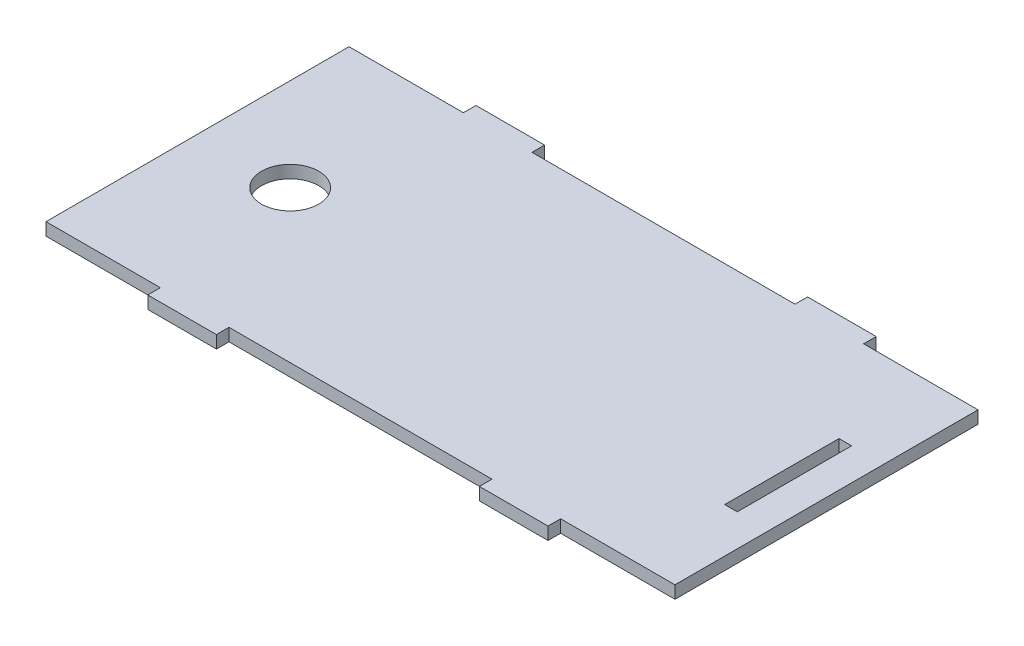
ISO-10303-21;
HEADER;
FILE_DESCRIPTION(('STEP AP214'),'2;1');
FILE_NAME('part.step','',(''),(''),'','','');
FILE_SCHEMA(('AUTOMOTIVE_DESIGN { 1 0 10303 214 1 1 1 1 }'));
ENDSEC;
DATA;
#1=APPLICATION_CONTEXT('core data for automotive mechanical design processes');
#2=APPLICATION_PROTOCOL_DEFINITION('international standard','automotive_design',2000,#1);
#3=PRODUCT_CONTEXT('',#1,'mechanical');
#4=PRODUCT('Part','Part','',(#3));
#5=PRODUCT_RELATED_PRODUCT_CATEGORY('part','',(#4));
#6=PRODUCT_DEFINITION_FORMATION('','',#4);
#7=PRODUCT_DEFINITION_CONTEXT('part definition',#1,'design');
#8=PRODUCT_DEFINITION('design','',#6,#7);
#9=PRODUCT_DEFINITION_SHAPE('','',#8);
#10=(LENGTH_UNIT() NAMED_UNIT(*) SI_UNIT(.MILLI.,.METRE.));
#11=(NAMED_UNIT(*) PLANE_ANGLE_UNIT() SI_UNIT($,.RADIAN.));
#12=(NAMED_UNIT(*) SI_UNIT($,.STERADIAN.) SOLID_ANGLE_UNIT());
#13=UNCERTAINTY_MEASURE_WITH_UNIT(LENGTH_MEASURE(1.E-05),#10,'distance_accuracy_value','');
#14=(GEOMETRIC_REPRESENTATION_CONTEXT(3) GLOBAL_UNCERTAINTY_ASSIGNED_CONTEXT((#13)) GLOBAL_UNIT_ASSIGNED_CONTEXT((#10,
#11,#12)) REPRESENTATION_CONTEXT('',''));
#15=CARTESIAN_POINT('',(0.,0.,0.));
#16=DIRECTION('',(0.,0.,1.));
#17=DIRECTION('',(1.,0.,0.));
#18=AXIS2_PLACEMENT_3D('',#15,#16,#17);
#19=CARTESIAN_POINT('',(0.,2.794,0.));
#20=DIRECTION('',(0.,-1.,0.));
#21=DIRECTION('',(0.,0.,-1.));
#22=AXIS2_PLACEMENT_3D('',#19,#20,#21);
#23=PLANE('',#22);
#24=DIRECTION('',(0.,0.,1.));
#25=VECTOR('',#24,1.);
#26=CARTESIAN_POINT('',(129.794,2.794,-20.955));
#27=LINE('',#26,#25);
#28=CARTESIAN_POINT('',(129.794,2.794,-46.355));
#29=VERTEX_POINT('',#28);
#30=CARTESIAN_POINT('',(129.794,2.794,-20.955));
#31=VERTEX_POINT('',#30);
#32=EDGE_CURVE('E194',#29,#31,#27,.T.);
#33=ORIENTED_EDGE('',*,*,#32,.F.);
#34=DIRECTION('',(-1.,0.,0.));
#35=VECTOR('',#34,1.);
#36=CARTESIAN_POINT('',(132.588,2.794,-46.355));
#37=LINE('',#36,#35);
#38=CARTESIAN_POINT('',(132.588,2.794,-46.355));
#39=VERTEX_POINT('',#38);
#40=EDGE_CURVE('E217',#39,#29,#37,.T.);
#41=ORIENTED_EDGE('',*,*,#40,.F.);
#42=DIRECTION('',(0.,0.,-1.));
#43=VECTOR('',#42,1.);
#44=CARTESIAN_POINT('',(132.588,2.794,-20.955));
#45=LINE('',#44,#43);
#46=CARTESIAN_POINT('',(132.588,2.794,-20.955));
#47=VERTEX_POINT('',#46);
#48=EDGE_CURVE('E215',#47,#39,#45,.T.);
#49=ORIENTED_EDGE('',*,*,#48,.F.);
#50=DIRECTION('',(1.,0.,0.));
#51=VECTOR('',#50,1.);
#52=CARTESIAN_POINT('',(132.588,2.794,-20.955));
#53=LINE('',#52,#51);
#54=EDGE_CURVE('E202',#31,#47,#53,.T.);
#55=ORIENTED_EDGE('',*,*,#54,.F.);
#56=EDGE_LOOP('',(#33,#41,#49,#55));
#57=FACE_BOUND('',#56,.T.);
#58=DIRECTION('',(0.,0.,1.));
#59=VECTOR('',#58,1.);
#60=CARTESIAN_POINT('',(0.,2.794,0.));
#61=LINE('',#60,#59);
#62=CARTESIAN_POINT('',(0.,2.794,-67.31));
#63=VERTEX_POINT('',#62);
#64=CARTESIAN_POINT('',(0.,2.794,0.));
#65=VERTEX_POINT('',#64);
#66=EDGE_CURVE('E233',#63,#65,#61,.T.);
#67=ORIENTED_EDGE('',*,*,#66,.T.);
#68=DIRECTION('',(1.,0.,0.));
#69=VECTOR('',#68,1.);
#70=CARTESIAN_POINT('',(0.,2.794,0.));
#71=LINE('',#70,#69);
#72=CARTESIAN_POINT('',(25.4,2.794,0.));
#73=VERTEX_POINT('',#72);
#74=EDGE_CURVE('E236',#65,#73,#71,.T.);
#75=ORIENTED_EDGE('',*,*,#74,.T.);
#76=DIRECTION('',(0.,0.,1.));
#77=VECTOR('',#76,1.);
#78=CARTESIAN_POINT('',(25.4,2.794,0.));
#79=LINE('',#78,#77);
#80=CARTESIAN_POINT('',(25.4,2.794,2.794));
#81=VERTEX_POINT('',#80);
#82=EDGE_CURVE('E239',#73,#81,#79,.T.);
#83=ORIENTED_EDGE('',*,*,#82,.T.);
#84=DIRECTION('',(1.,0.,0.));
#85=VECTOR('',#84,1.);
#86=CARTESIAN_POINT('',(25.4,2.794,2.794));
#87=LINE('',#86,#85);
#88=CARTESIAN_POINT('',(40.64,2.794,2.794));
#89=VERTEX_POINT('',#88);
#90=EDGE_CURVE('E241',#81,#89,#87,.T.);
#91=ORIENTED_EDGE('',*,*,#90,.T.);
#92=DIRECTION('',(0.,0.,-1.));
#93=VECTOR('',#92,1.);
#94=CARTESIAN_POINT('',(40.64,2.794,0.));
#95=LINE('',#94,#93);
#96=CARTESIAN_POINT('',(40.64,2.794,0.));
#97=VERTEX_POINT('',#96);
#98=EDGE_CURVE('E243',#89,#97,#95,.T.);
#99=ORIENTED_EDGE('',*,*,#98,.T.);
#100=DIRECTION('',(1.,0.,0.));
#101=VECTOR('',#100,1.);
#102=CARTESIAN_POINT('',(40.64,2.794,0.));
#103=LINE('',#102,#101);
#104=CARTESIAN_POINT('',(99.06,2.794,0.));
#105=VERTEX_POINT('',#104);
#106=EDGE_CURVE('E245',#97,#105,#103,.T.);
#107=ORIENTED_EDGE('',*,*,#106,.T.);
#108=DIRECTION('',(0.,0.,1.));
#109=VECTOR('',#108,1.);
#110=CARTESIAN_POINT('',(99.06,2.794,0.));
#111=LINE('',#110,#109);
#112=CARTESIAN_POINT('',(99.06,2.794,2.794));
#113=VERTEX_POINT('',#112);
#114=EDGE_CURVE('E247',#105,#113,#111,.T.);
#115=ORIENTED_EDGE('',*,*,#114,.T.);
#116=DIRECTION('',(1.,0.,0.));
#117=VECTOR('',#116,1.);
#118=CARTESIAN_POINT('',(99.06,2.794,2.794));
#119=LINE('',#118,#117);
#120=CARTESIAN_POINT('',(114.300000000001,2.794,2.79399999999985));
#121=VERTEX_POINT('',#120);
#122=EDGE_CURVE('E249',#113,#121,#119,.T.);
#123=ORIENTED_EDGE('',*,*,#122,.T.);
#124=DIRECTION('',(0.,0.,-1.));
#125=VECTOR('',#124,1.);
#126=CARTESIAN_POINT('',(114.300000000001,2.794,-1.53523027623947E-13));
#127=LINE('',#126,#125);
#128=CARTESIAN_POINT('',(114.300000000001,2.794,-1.53523027623947E-13));
#129=VERTEX_POINT('',#128);
#130=EDGE_CURVE('E251',#121,#129,#127,.T.);
#131=ORIENTED_EDGE('',*,*,#130,.T.);
#132=DIRECTION('',(1.,0.,0.));
#133=VECTOR('',#132,1.);
#134=CARTESIAN_POINT('',(114.300000000001,2.794,-1.53523027623947E-13));
#135=LINE('',#134,#133);
#136=CARTESIAN_POINT('',(139.7,2.794,0.));
#137=VERTEX_POINT('',#136);
#138=EDGE_CURVE('E253',#129,#137,#135,.T.);
#139=ORIENTED_EDGE('',*,*,#138,.T.);
#140=DIRECTION('',(0.,0.,-1.));
#141=VECTOR('',#140,1.);
#142=CARTESIAN_POINT('',(139.7,2.794,0.));
#143=LINE('',#142,#141);
#144=CARTESIAN_POINT('',(139.7,2.794,-67.31));
#145=VERTEX_POINT('',#144);
#146=EDGE_CURVE('E255',#137,#145,#143,.T.);
#147=ORIENTED_EDGE('',*,*,#146,.T.);
#148=DIRECTION('',(-1.,0.,0.));
#149=VECTOR('',#148,1.);
#150=CARTESIAN_POINT('',(114.3,2.794,-67.31));
#151=LINE('',#150,#149);
#152=CARTESIAN_POINT('',(114.3,2.794,-67.31));
#153=VERTEX_POINT('',#152);
#154=EDGE_CURVE('E257',#145,#153,#151,.T.);
#155=ORIENTED_EDGE('',*,*,#154,.T.);
#156=DIRECTION('',(0.,0.,-1.));
#157=VECTOR('',#156,1.);
#158=CARTESIAN_POINT('',(114.3,2.794,-70.104));
#159=LINE('',#158,#157);
#160=CARTESIAN_POINT('',(114.3,2.794,-70.104));
#161=VERTEX_POINT('',#160);
#162=EDGE_CURVE('E259',#153,#161,#159,.T.);
#163=ORIENTED_EDGE('',*,*,#162,.T.);
#164=DIRECTION('',(-1.,0.,0.));
#165=VECTOR('',#164,1.);
#166=CARTESIAN_POINT('',(99.06,2.794,-70.104));
#167=LINE('',#166,#165);
#168=CARTESIAN_POINT('',(99.06,2.794,-70.104));
#169=VERTEX_POINT('',#168);
#170=EDGE_CURVE('E261',#161,#169,#167,.T.);
#171=ORIENTED_EDGE('',*,*,#170,.T.);
#172=DIRECTION('',(0.,0.,1.));
#173=VECTOR('',#172,1.);
#174=CARTESIAN_POINT('',(99.06,2.794,-70.104));
#175=LINE('',#174,#173);
#176=CARTESIAN_POINT('',(99.06,2.794,-67.31));
#177=VERTEX_POINT('',#176);
#178=EDGE_CURVE('E263',#169,#177,#175,.T.);
#179=ORIENTED_EDGE('',*,*,#178,.T.);
#180=DIRECTION('',(-1.,0.,0.));
#181=VECTOR('',#180,1.);
#182=CARTESIAN_POINT('',(40.64,2.794,-67.31));
#183=LINE('',#182,#181);
#184=CARTESIAN_POINT('',(40.64,2.794,-67.31));
#185=VERTEX_POINT('',#184);
#186=EDGE_CURVE('E265',#177,#185,#183,.T.);
#187=ORIENTED_EDGE('',*,*,#186,.T.);
#188=DIRECTION('',(0.,0.,-1.));
#189=VECTOR('',#188,1.);
#190=CARTESIAN_POINT('',(40.64,2.794,-70.104));
#191=LINE('',#190,#189);
#192=CARTESIAN_POINT('',(40.64,2.794,-70.104));
#193=VERTEX_POINT('',#192);
#194=EDGE_CURVE('E267',#185,#193,#191,.T.);
#195=ORIENTED_EDGE('',*,*,#194,.T.);
#196=DIRECTION('',(-1.,0.,0.));
#197=VECTOR('',#196,1.);
#198=CARTESIAN_POINT('',(25.4,2.794,-70.104));
#199=LINE('',#198,#197);
#200=CARTESIAN_POINT('',(25.4,2.794,-70.104));
#201=VERTEX_POINT('',#200);
#202=EDGE_CURVE('E269',#193,#201,#199,.T.);
#203=ORIENTED_EDGE('',*,*,#202,.T.);
#204=DIRECTION('',(0.,0.,1.));
#205=VECTOR('',#204,1.);
#206=CARTESIAN_POINT('',(25.4,2.794,-70.104));
#207=LINE('',#206,#205);
#208=CARTESIAN_POINT('',(25.4,2.794,-67.31));
#209=VERTEX_POINT('',#208);
#210=EDGE_CURVE('E271',#201,#209,#207,.T.);
#211=ORIENTED_EDGE('',*,*,#210,.T.);
#212=DIRECTION('',(-1.,0.,0.));
#213=VECTOR('',#212,1.);
#214=CARTESIAN_POINT('',(0.,2.794,-67.31));
#215=LINE('',#214,#213);
#216=EDGE_CURVE('E273',#209,#63,#215,.T.);
#217=ORIENTED_EDGE('',*,*,#216,.T.);
#218=EDGE_LOOP('',(#67,#75,#83,#91,#99,#107,#115,#123,#131,#139,#147,#155,#163,#171,#179,#187,
#195,#203,#211,#217));
#219=FACE_BOUND('',#218,.T.);
#220=CARTESIAN_POINT('',(20.574,2.794,-33.655));
#221=DIRECTION('',(0.,1.,0.));
#222=DIRECTION('',(0.,0.,1.));
#223=AXIS2_PLACEMENT_3D('',#220,#221,#222);
#224=CIRCLE('',#223,6.35);
#225=CARTESIAN_POINT('',(20.574,2.794,-27.305));
#226=VERTEX_POINT('',#225);
#227=EDGE_CURVE('E223',#226,#226,#224,.T.);
#228=ORIENTED_EDGE('',*,*,#227,.F.);
#229=EDGE_LOOP('',(#228));
#230=FACE_BOUND('',#229,.T.);
#231=ADVANCED_FACE('F33',(#57,#219,#230),#23,.F.);
#232=CARTESIAN_POINT('',(0.,0.,0.));
#233=DIRECTION('',(0.,-1.,0.));
#234=DIRECTION('',(0.,0.,-1.));
#235=AXIS2_PLACEMENT_3D('',#232,#233,#234);
#236=PLANE('',#235);
#237=DIRECTION('',(-1.,0.,0.));
#238=VECTOR('',#237,1.);
#239=CARTESIAN_POINT('',(132.588,0.,-46.355));
#240=LINE('',#239,#238);
#241=CARTESIAN_POINT('',(132.588,0.,-46.355));
#242=VERTEX_POINT('',#241);
#243=CARTESIAN_POINT('',(129.794,0.,-46.355));
#244=VERTEX_POINT('',#243);
#245=EDGE_CURVE('E203',#242,#244,#240,.T.);
#246=ORIENTED_EDGE('',*,*,#245,.T.);
#247=DIRECTION('',(0.,0.,1.));
#248=VECTOR('',#247,1.);
#249=CARTESIAN_POINT('',(129.794,0.,-20.955));
#250=LINE('',#249,#248);
#251=CARTESIAN_POINT('',(129.794,0.,-20.955));
#252=VERTEX_POINT('',#251);
#253=EDGE_CURVE('E56',#244,#252,#250,.T.);
#254=ORIENTED_EDGE('',*,*,#253,.T.);
#255=DIRECTION('',(1.,0.,0.));
#256=VECTOR('',#255,1.);
#257=CARTESIAN_POINT('',(132.588,0.,-20.955));
#258=LINE('',#257,#256);
#259=CARTESIAN_POINT('',(132.588,0.,-20.955));
#260=VERTEX_POINT('',#259);
#261=EDGE_CURVE('E209',#252,#260,#258,.T.);
#262=ORIENTED_EDGE('',*,*,#261,.T.);
#263=DIRECTION('',(0.,0.,-1.));
#264=VECTOR('',#263,1.);
#265=CARTESIAN_POINT('',(132.588,0.,-20.955));
#266=LINE('',#265,#264);
#267=EDGE_CURVE('E225',#260,#242,#266,.T.);
#268=ORIENTED_EDGE('',*,*,#267,.T.);
#269=EDGE_LOOP('',(#246,#254,#262,#268));
#270=FACE_BOUND('',#269,.T.);
#271=DIRECTION('',(0.,0.,1.));
#272=VECTOR('',#271,1.);
#273=CARTESIAN_POINT('',(0.,0.,0.));
#274=LINE('',#273,#272);
#275=CARTESIAN_POINT('',(0.,0.,-67.31));
#276=VERTEX_POINT('',#275);
#277=CARTESIAN_POINT('',(0.,0.,0.));
#278=VERTEX_POINT('',#277);
#279=EDGE_CURVE('E210',#276,#278,#274,.T.);
#280=ORIENTED_EDGE('',*,*,#279,.F.);
#281=DIRECTION('',(-1.,0.,0.));
#282=VECTOR('',#281,1.);
#283=CARTESIAN_POINT('',(0.,0.,-67.31));
#284=LINE('',#283,#282);
#285=CARTESIAN_POINT('',(25.4,0.,-67.31));
#286=VERTEX_POINT('',#285);
#287=EDGE_CURVE('E237',#286,#276,#284,.T.);
#288=ORIENTED_EDGE('',*,*,#287,.F.);
#289=DIRECTION('',(0.,0.,1.));
#290=VECTOR('',#289,1.);
#291=CARTESIAN_POINT('',(25.4,0.,-70.104));
#292=LINE('',#291,#290);
#293=CARTESIAN_POINT('',(25.4,0.,-70.104));
#294=VERTEX_POINT('',#293);
#295=EDGE_CURVE('E312',#294,#286,#292,.T.);
#296=ORIENTED_EDGE('',*,*,#295,.F.);
#297=DIRECTION('',(-1.,0.,0.));
#298=VECTOR('',#297,1.);
#299=CARTESIAN_POINT('',(25.4,0.,-70.104));
#300=LINE('',#299,#298);
#301=CARTESIAN_POINT('',(40.64,0.,-70.104));
#302=VERTEX_POINT('',#301);
#303=EDGE_CURVE('E310',#302,#294,#300,.T.);
#304=ORIENTED_EDGE('',*,*,#303,.F.);
#305=DIRECTION('',(0.,0.,-1.));
#306=VECTOR('',#305,1.);
#307=CARTESIAN_POINT('',(40.64,0.,-70.104));
#308=LINE('',#307,#306);
#309=CARTESIAN_POINT('',(40.64,0.,-67.31));
#310=VERTEX_POINT('',#309);
#311=EDGE_CURVE('E308',#310,#302,#308,.T.);
#312=ORIENTED_EDGE('',*,*,#311,.F.);
#313=DIRECTION('',(-1.,0.,0.));
#314=VECTOR('',#313,1.);
#315=CARTESIAN_POINT('',(40.64,0.,-67.31));
#316=LINE('',#315,#314);
#317=CARTESIAN_POINT('',(99.06,0.,-67.31));
#318=VERTEX_POINT('',#317);
#319=EDGE_CURVE('E306',#318,#310,#316,.T.);
#320=ORIENTED_EDGE('',*,*,#319,.F.);
#321=DIRECTION('',(0.,0.,1.));
#322=VECTOR('',#321,1.);
#323=CARTESIAN_POINT('',(99.06,0.,-70.104));
#324=LINE('',#323,#322);
#325=CARTESIAN_POINT('',(99.06,0.,-70.104));
#326=VERTEX_POINT('',#325);
#327=EDGE_CURVE('E304',#326,#318,#324,.T.);
#328=ORIENTED_EDGE('',*,*,#327,.F.);
#329=DIRECTION('',(-1.,0.,0.));
#330=VECTOR('',#329,1.);
#331=CARTESIAN_POINT('',(99.06,0.,-70.104));
#332=LINE('',#331,#330);
#333=CARTESIAN_POINT('',(114.3,0.,-70.104));
#334=VERTEX_POINT('',#333);
#335=EDGE_CURVE('E302',#334,#326,#332,.T.);
#336=ORIENTED_EDGE('',*,*,#335,.F.);
#337=DIRECTION('',(0.,0.,-1.));
#338=VECTOR('',#337,1.);
#339=CARTESIAN_POINT('',(114.3,0.,-70.104));
#340=LINE('',#339,#338);
#341=CARTESIAN_POINT('',(114.3,0.,-67.31));
#342=VERTEX_POINT('',#341);
#343=EDGE_CURVE('E300',#342,#334,#340,.T.);
#344=ORIENTED_EDGE('',*,*,#343,.F.);
#345=DIRECTION('',(-1.,0.,0.));
#346=VECTOR('',#345,1.);
#347=CARTESIAN_POINT('',(114.3,0.,-67.31));
#348=LINE('',#347,#346);
#349=CARTESIAN_POINT('',(139.7,0.,-67.31));
#350=VERTEX_POINT('',#349);
#351=EDGE_CURVE('E298',#350,#342,#348,.T.);
#352=ORIENTED_EDGE('',*,*,#351,.F.);
#353=DIRECTION('',(0.,0.,-1.));
#354=VECTOR('',#353,1.);
#355=CARTESIAN_POINT('',(139.7,0.,0.));
#356=LINE('',#355,#354);
#357=CARTESIAN_POINT('',(139.7,0.,0.));
#358=VERTEX_POINT('',#357);
#359=EDGE_CURVE('E296',#358,#350,#356,.T.);
#360=ORIENTED_EDGE('',*,*,#359,.F.);
#361=DIRECTION('',(1.,0.,0.));
#362=VECTOR('',#361,1.);
#363=CARTESIAN_POINT('',(114.300000000001,0.,-1.53523027623947E-13));
#364=LINE('',#363,#362);
#365=CARTESIAN_POINT('',(114.300000000001,0.,-1.53523027623947E-13));
#366=VERTEX_POINT('',#365);
#367=EDGE_CURVE('E294',#366,#358,#364,.T.);
#368=ORIENTED_EDGE('',*,*,#367,.F.);
#369=DIRECTION('',(0.,0.,-1.));
#370=VECTOR('',#369,1.);
#371=CARTESIAN_POINT('',(114.300000000001,0.,-1.53523027623947E-13));
#372=LINE('',#371,#370);
#373=CARTESIAN_POINT('',(114.300000000001,0.,2.79399999999985));
#374=VERTEX_POINT('',#373);
#375=EDGE_CURVE('E292',#374,#366,#372,.T.);
#376=ORIENTED_EDGE('',*,*,#375,.F.);
#377=DIRECTION('',(1.,0.,0.));
#378=VECTOR('',#377,1.);
#379=CARTESIAN_POINT('',(99.06,0.,2.794));
#380=LINE('',#379,#378);
#381=CARTESIAN_POINT('',(99.06,0.,2.794));
#382=VERTEX_POINT('',#381);
#383=EDGE_CURVE('E290',#382,#374,#380,.T.);
#384=ORIENTED_EDGE('',*,*,#383,.F.);
#385=DIRECTION('',(0.,0.,1.));
#386=VECTOR('',#385,1.);
#387=CARTESIAN_POINT('',(99.06,0.,0.));
#388=LINE('',#387,#386);
#389=CARTESIAN_POINT('',(99.06,0.,0.));
#390=VERTEX_POINT('',#389);
#391=EDGE_CURVE('E288',#390,#382,#388,.T.);
#392=ORIENTED_EDGE('',*,*,#391,.F.);
#393=DIRECTION('',(1.,0.,0.));
#394=VECTOR('',#393,1.);
#395=CARTESIAN_POINT('',(40.64,0.,0.));
#396=LINE('',#395,#394);
#397=CARTESIAN_POINT('',(40.64,0.,0.));
#398=VERTEX_POINT('',#397);
#399=EDGE_CURVE('E286',#398,#390,#396,.T.);
#400=ORIENTED_EDGE('',*,*,#399,.F.);
#401=DIRECTION('',(0.,0.,-1.));
#402=VECTOR('',#401,1.);
#403=CARTESIAN_POINT('',(40.64,0.,0.));
#404=LINE('',#403,#402);
#405=CARTESIAN_POINT('',(40.64,0.,2.794));
#406=VERTEX_POINT('',#405);
#407=EDGE_CURVE('E284',#406,#398,#404,.T.);
#408=ORIENTED_EDGE('',*,*,#407,.F.);
#409=DIRECTION('',(1.,0.,0.));
#410=VECTOR('',#409,1.);
#411=CARTESIAN_POINT('',(25.4,0.,2.794));
#412=LINE('',#411,#410);
#413=CARTESIAN_POINT('',(25.4,0.,2.794));
#414=VERTEX_POINT('',#413);
#415=EDGE_CURVE('E282',#414,#406,#412,.T.);
#416=ORIENTED_EDGE('',*,*,#415,.F.);
#417=DIRECTION('',(0.,0.,1.));
#418=VECTOR('',#417,1.);
#419=CARTESIAN_POINT('',(25.4,0.,0.));
#420=LINE('',#419,#418);
#421=CARTESIAN_POINT('',(25.4,0.,0.));
#422=VERTEX_POINT('',#421);
#423=EDGE_CURVE('E280',#422,#414,#420,.T.);
#424=ORIENTED_EDGE('',*,*,#423,.F.);
#425=DIRECTION('',(1.,0.,0.));
#426=VECTOR('',#425,1.);
#427=CARTESIAN_POINT('',(0.,0.,0.));
#428=LINE('',#427,#426);
#429=EDGE_CURVE('E278',#278,#422,#428,.T.);
#430=ORIENTED_EDGE('',*,*,#429,.F.);
#431=EDGE_LOOP('',(#280,#288,#296,#304,#312,#320,#328,#336,#344,#352,#360,#368,#376,#384,#392,
#400,#408,#416,#424,#430));
#432=FACE_BOUND('',#431,.T.);
#433=CARTESIAN_POINT('',(20.574,0.,-33.655));
#434=DIRECTION('',(0.,1.,0.));
#435=DIRECTION('',(0.,0.,1.));
#436=AXIS2_PLACEMENT_3D('',#433,#434,#435);
#437=CIRCLE('',#436,6.35);
#438=CARTESIAN_POINT('',(20.574,0.,-27.305));
#439=VERTEX_POINT('',#438);
#440=EDGE_CURVE('E694',#439,#439,#437,.T.);
#441=ORIENTED_EDGE('',*,*,#440,.T.);
#442=EDGE_LOOP('',(#441));
#443=FACE_BOUND('',#442,.T.);
#444=ADVANCED_FACE('F378',(#270,#432,#443),#236,.T.);
#445=CARTESIAN_POINT('',(0.,2.794,0.));
#446=DIRECTION('',(1.,0.,0.));
#447=DIRECTION('',(0.,0.,-1.));
#448=AXIS2_PLACEMENT_3D('',#445,#446,#447);
#449=PLANE('',#448);
#450=ORIENTED_EDGE('',*,*,#279,.T.);
#451=DIRECTION('',(0.,-1.,0.));
#452=VECTOR('',#451,1.);
#453=CARTESIAN_POINT('',(0.,2.794,0.));
#454=LINE('',#453,#452);
#455=EDGE_CURVE('E11',#65,#278,#454,.T.);
#456=ORIENTED_EDGE('',*,*,#455,.F.);
#457=ORIENTED_EDGE('',*,*,#66,.F.);
#458=DIRECTION('',(0.,-1.,0.));
#459=VECTOR('',#458,1.);
#460=CARTESIAN_POINT('',(0.,2.794,-67.31));
#461=LINE('',#460,#459);
#462=EDGE_CURVE('E275',#63,#276,#461,.T.);
#463=ORIENTED_EDGE('',*,*,#462,.T.);
#464=EDGE_LOOP('',(#450,#456,#457,#463));
#465=FACE_BOUND('',#464,.T.);
#466=ADVANCED_FACE('F35',(#465),#449,.F.);
#467=CARTESIAN_POINT('',(0.,2.794,0.));
#468=DIRECTION('',(0.,0.,-1.));
#469=DIRECTION('',(-1.,0.,0.));
#470=AXIS2_PLACEMENT_3D('',#467,#468,#469);
#471=PLANE('',#470);
#472=ORIENTED_EDGE('',*,*,#429,.T.);
#473=DIRECTION('',(0.,-1.,0.));
#474=VECTOR('',#473,1.);
#475=CARTESIAN_POINT('',(25.4,2.794,0.));
#476=LINE('',#475,#474);
#477=EDGE_CURVE('E41',#73,#422,#476,.T.);
#478=ORIENTED_EDGE('',*,*,#477,.F.);
#479=ORIENTED_EDGE('',*,*,#74,.F.);
#480=ORIENTED_EDGE('',*,*,#455,.T.);
#481=EDGE_LOOP('',(#472,#478,#479,#480));
#482=FACE_BOUND('',#481,.T.);
#483=ADVANCED_FACE('F395',(#482),#471,.F.);
#484=CARTESIAN_POINT('',(25.4,2.794,0.));
#485=DIRECTION('',(1.,0.,0.));
#486=DIRECTION('',(0.,0.,-1.));
#487=AXIS2_PLACEMENT_3D('',#484,#485,#486);
#488=PLANE('',#487);
#489=ORIENTED_EDGE('',*,*,#423,.T.);
#490=DIRECTION('',(0.,-1.,0.));
#491=VECTOR('',#490,1.);
#492=CARTESIAN_POINT('',(25.4,2.794,2.794));
#493=LINE('',#492,#491);
#494=EDGE_CURVE('E365',#81,#414,#493,.T.);
#495=ORIENTED_EDGE('',*,*,#494,.F.);
#496=ORIENTED_EDGE('',*,*,#82,.F.);
#497=ORIENTED_EDGE('',*,*,#477,.T.);
#498=EDGE_LOOP('',(#489,#495,#496,#497));
#499=FACE_BOUND('',#498,.T.);
#500=ADVANCED_FACE('F372',(#499),#488,.F.);
#501=CARTESIAN_POINT('',(25.4,2.794,2.794));
#502=DIRECTION('',(0.,0.,-1.));
#503=DIRECTION('',(-1.,0.,0.));
#504=AXIS2_PLACEMENT_3D('',#501,#502,#503);
#505=PLANE('',#504);
#506=ORIENTED_EDGE('',*,*,#415,.T.);
#507=DIRECTION('',(0.,-1.,0.));
#508=VECTOR('',#507,1.);
#509=CARTESIAN_POINT('',(40.64,2.794,2.794));
#510=LINE('',#509,#508);
#511=EDGE_CURVE('E362',#89,#406,#510,.T.);
#512=ORIENTED_EDGE('',*,*,#511,.F.);
#513=ORIENTED_EDGE('',*,*,#90,.F.);
#514=ORIENTED_EDGE('',*,*,#494,.T.);
#515=EDGE_LOOP('',(#506,#512,#513,#514));
#516=FACE_BOUND('',#515,.T.);
#517=ADVANCED_FACE('F384',(#516),#505,.F.);
#518=CARTESIAN_POINT('',(40.64,2.794,0.));
#519=DIRECTION('',(-1.,0.,0.));
#520=DIRECTION('',(0.,0.,1.));
#521=AXIS2_PLACEMENT_3D('',#518,#519,#520);
#522=PLANE('',#521);
#523=ORIENTED_EDGE('',*,*,#407,.T.);
#524=DIRECTION('',(0.,-1.,0.));
#525=VECTOR('',#524,1.);
#526=CARTESIAN_POINT('',(40.64,2.794,0.));
#527=LINE('',#526,#525);
#528=EDGE_CURVE('E359',#97,#398,#527,.T.);
#529=ORIENTED_EDGE('',*,*,#528,.F.);
#530=ORIENTED_EDGE('',*,*,#98,.F.);
#531=ORIENTED_EDGE('',*,*,#511,.T.);
#532=EDGE_LOOP('',(#523,#529,#530,#531));
#533=FACE_BOUND('',#532,.T.);
#534=ADVANCED_FACE('F388',(#533),#522,.F.);
#535=CARTESIAN_POINT('',(40.64,2.794,0.));
#536=DIRECTION('',(0.,0.,-1.));
#537=DIRECTION('',(-1.,0.,0.));
#538=AXIS2_PLACEMENT_3D('',#535,#536,#537);
#539=PLANE('',#538);
#540=ORIENTED_EDGE('',*,*,#399,.T.);
#541=DIRECTION('',(0.,-1.,0.));
#542=VECTOR('',#541,1.);
#543=CARTESIAN_POINT('',(99.06,2.794,0.));
#544=LINE('',#543,#542);
#545=EDGE_CURVE('E356',#105,#390,#544,.T.);
#546=ORIENTED_EDGE('',*,*,#545,.F.);
#547=ORIENTED_EDGE('',*,*,#106,.F.);
#548=ORIENTED_EDGE('',*,*,#528,.T.);
#549=EDGE_LOOP('',(#540,#546,#547,#548));
#550=FACE_BOUND('',#549,.T.);
#551=ADVANCED_FACE('F468',(#550),#539,.F.);
#552=CARTESIAN_POINT('',(99.06,2.794,0.));
#553=DIRECTION('',(1.,0.,0.));
#554=DIRECTION('',(0.,0.,-1.));
#555=AXIS2_PLACEMENT_3D('',#552,#553,#554);
#556=PLANE('',#555);
#557=ORIENTED_EDGE('',*,*,#391,.T.);
#558=DIRECTION('',(0.,-1.,0.));
#559=VECTOR('',#558,1.);
#560=CARTESIAN_POINT('',(99.06,2.794,2.794));
#561=LINE('',#560,#559);
#562=EDGE_CURVE('E353',#113,#382,#561,.T.);
#563=ORIENTED_EDGE('',*,*,#562,.F.);
#564=ORIENTED_EDGE('',*,*,#114,.F.);
#565=ORIENTED_EDGE('',*,*,#545,.T.);
#566=EDGE_LOOP('',(#557,#563,#564,#565));
#567=FACE_BOUND('',#566,.T.);
#568=ADVANCED_FACE('F466',(#567),#556,.F.);
#569=CARTESIAN_POINT('',(99.06,2.794,2.794));
#570=DIRECTION('',(0.,0.,-1.));
#571=DIRECTION('',(-1.,0.,0.));
#572=AXIS2_PLACEMENT_3D('',#569,#570,#571);
#573=PLANE('',#572);
#574=ORIENTED_EDGE('',*,*,#383,.T.);
#575=DIRECTION('',(0.,-1.,0.));
#576=VECTOR('',#575,1.);
#577=CARTESIAN_POINT('',(114.300000000001,2.794,2.79399999999985));
#578=LINE('',#577,#576);
#579=EDGE_CURVE('E350',#121,#374,#578,.T.);
#580=ORIENTED_EDGE('',*,*,#579,.F.);
#581=ORIENTED_EDGE('',*,*,#122,.F.);
#582=ORIENTED_EDGE('',*,*,#562,.T.);
#583=EDGE_LOOP('',(#574,#580,#581,#582));
#584=FACE_BOUND('',#583,.T.);
#585=ADVANCED_FACE('F461',(#584),#573,.F.);
#586=CARTESIAN_POINT('',(114.300000000001,2.794,-1.53523027623947E-13));
#587=DIRECTION('',(-1.,0.,0.));
#588=DIRECTION('',(0.,0.,1.));
#589=AXIS2_PLACEMENT_3D('',#586,#587,#588);
#590=PLANE('',#589);
#591=ORIENTED_EDGE('',*,*,#375,.T.);
#592=DIRECTION('',(0.,-1.,0.));
#593=VECTOR('',#592,1.);
#594=CARTESIAN_POINT('',(114.300000000001,2.794,-1.53523027623947E-13));
#595=LINE('',#594,#593);
#596=EDGE_CURVE('E347',#129,#366,#595,.T.);
#597=ORIENTED_EDGE('',*,*,#596,.F.);
#598=ORIENTED_EDGE('',*,*,#130,.F.);
#599=ORIENTED_EDGE('',*,*,#579,.T.);
#600=EDGE_LOOP('',(#591,#597,#598,#599));
#601=FACE_BOUND('',#600,.T.);
#602=ADVANCED_FACE('F456',(#601),#590,.F.);
#603=CARTESIAN_POINT('',(114.300000000001,2.794,-1.53523027623947E-13));
#604=DIRECTION('',(0.,0.,-1.));
#605=DIRECTION('',(-1.,0.,0.));
#606=AXIS2_PLACEMENT_3D('',#603,#604,#605);
#607=PLANE('',#606);
#608=ORIENTED_EDGE('',*,*,#367,.T.);
#609=DIRECTION('',(0.,-1.,0.));
#610=VECTOR('',#609,1.);
#611=CARTESIAN_POINT('',(139.7,2.794,0.));
#612=LINE('',#611,#610);
#613=EDGE_CURVE('E344',#137,#358,#612,.T.);
#614=ORIENTED_EDGE('',*,*,#613,.F.);
#615=ORIENTED_EDGE('',*,*,#138,.F.);
#616=ORIENTED_EDGE('',*,*,#596,.T.);
#617=EDGE_LOOP('',(#608,#614,#615,#616));
#618=FACE_BOUND('',#617,.T.);
#619=ADVANCED_FACE('F452',(#618),#607,.F.);
#620=CARTESIAN_POINT('',(139.7,2.794,0.));
#621=DIRECTION('',(-1.,0.,0.));
#622=DIRECTION('',(0.,0.,1.));
#623=AXIS2_PLACEMENT_3D('',#620,#621,#622);
#624=PLANE('',#623);
#625=ORIENTED_EDGE('',*,*,#359,.T.);
#626=DIRECTION('',(0.,-1.,0.));
#627=VECTOR('',#626,1.);
#628=CARTESIAN_POINT('',(139.7,2.794,-67.31));
#629=LINE('',#628,#627);
#630=EDGE_CURVE('E341',#145,#350,#629,.T.);
#631=ORIENTED_EDGE('',*,*,#630,.F.);
#632=ORIENTED_EDGE('',*,*,#146,.F.);
#633=ORIENTED_EDGE('',*,*,#613,.T.);
#634=EDGE_LOOP('',(#625,#631,#632,#633));
#635=FACE_BOUND('',#634,.T.);
#636=ADVANCED_FACE('F447',(#635),#624,.F.);
#637=CARTESIAN_POINT('',(114.3,2.794,-67.31));
#638=DIRECTION('',(0.,0.,1.));
#639=DIRECTION('',(1.,0.,0.));
#640=AXIS2_PLACEMENT_3D('',#637,#638,#639);
#641=PLANE('',#640);
#642=ORIENTED_EDGE('',*,*,#351,.T.);
#643=DIRECTION('',(0.,-1.,0.));
#644=VECTOR('',#643,1.);
#645=CARTESIAN_POINT('',(114.3,2.794,-67.31));
#646=LINE('',#645,#644);
#647=EDGE_CURVE('E338',#153,#342,#646,.T.);
#648=ORIENTED_EDGE('',*,*,#647,.F.);
#649=ORIENTED_EDGE('',*,*,#154,.F.);
#650=ORIENTED_EDGE('',*,*,#630,.T.);
#651=EDGE_LOOP('',(#642,#648,#649,#650));
#652=FACE_BOUND('',#651,.T.);
#653=ADVANCED_FACE('F441',(#652),#641,.F.);
#654=CARTESIAN_POINT('',(114.3,2.794,-70.104));
#655=DIRECTION('',(-1.,0.,0.));
#656=DIRECTION('',(0.,0.,1.));
#657=AXIS2_PLACEMENT_3D('',#654,#655,#656);
#658=PLANE('',#657);
#659=ORIENTED_EDGE('',*,*,#343,.T.);
#660=DIRECTION('',(0.,-1.,0.));
#661=VECTOR('',#660,1.);
#662=CARTESIAN_POINT('',(114.3,2.794,-70.104));
#663=LINE('',#662,#661);
#664=EDGE_CURVE('E335',#161,#334,#663,.T.);
#665=ORIENTED_EDGE('',*,*,#664,.F.);
#666=ORIENTED_EDGE('',*,*,#162,.F.);
#667=ORIENTED_EDGE('',*,*,#647,.T.);
#668=EDGE_LOOP('',(#659,#665,#666,#667));
#669=FACE_BOUND('',#668,.T.);
#670=ADVANCED_FACE('F437',(#669),#658,.F.);
#671=CARTESIAN_POINT('',(99.06,2.794,-70.104));
#672=DIRECTION('',(0.,0.,1.));
#673=DIRECTION('',(1.,0.,0.));
#674=AXIS2_PLACEMENT_3D('',#671,#672,#673);
#675=PLANE('',#674);
#676=ORIENTED_EDGE('',*,*,#335,.T.);
#677=DIRECTION('',(0.,-1.,0.));
#678=VECTOR('',#677,1.);
#679=CARTESIAN_POINT('',(99.06,2.794,-70.104));
#680=LINE('',#679,#678);
#681=EDGE_CURVE('E332',#169,#326,#680,.T.);
#682=ORIENTED_EDGE('',*,*,#681,.F.);
#683=ORIENTED_EDGE('',*,*,#170,.F.);
#684=ORIENTED_EDGE('',*,*,#664,.T.);
#685=EDGE_LOOP('',(#676,#682,#683,#684));
#686=FACE_BOUND('',#685,.T.);
#687=ADVANCED_FACE('F432',(#686),#675,.F.);
#688=CARTESIAN_POINT('',(99.06,2.794,-70.104));
#689=DIRECTION('',(1.,0.,0.));
#690=DIRECTION('',(0.,0.,-1.));
#691=AXIS2_PLACEMENT_3D('',#688,#689,#690);
#692=PLANE('',#691);
#693=ORIENTED_EDGE('',*,*,#327,.T.);
#694=DIRECTION('',(0.,-1.,0.));
#695=VECTOR('',#694,1.);
#696=CARTESIAN_POINT('',(99.06,2.794,-67.31));
#697=LINE('',#696,#695);
#698=EDGE_CURVE('E329',#177,#318,#697,.T.);
#699=ORIENTED_EDGE('',*,*,#698,.F.);
#700=ORIENTED_EDGE('',*,*,#178,.F.);
#701=ORIENTED_EDGE('',*,*,#681,.T.);
#702=EDGE_LOOP('',(#693,#699,#700,#701));
#703=FACE_BOUND('',#702,.T.);
#704=ADVANCED_FACE('F426',(#703),#692,.F.);
#705=CARTESIAN_POINT('',(40.64,2.794,-67.31));
#706=DIRECTION('',(0.,0.,1.));
#707=DIRECTION('',(1.,0.,0.));
#708=AXIS2_PLACEMENT_3D('',#705,#706,#707);
#709=PLANE('',#708);
#710=ORIENTED_EDGE('',*,*,#319,.T.);
#711=DIRECTION('',(0.,-1.,0.));
#712=VECTOR('',#711,1.);
#713=CARTESIAN_POINT('',(40.64,2.794,-67.31));
#714=LINE('',#713,#712);
#715=EDGE_CURVE('E326',#185,#310,#714,.T.);
#716=ORIENTED_EDGE('',*,*,#715,.F.);
#717=ORIENTED_EDGE('',*,*,#186,.F.);
#718=ORIENTED_EDGE('',*,*,#698,.T.);
#719=EDGE_LOOP('',(#710,#716,#717,#718));
#720=FACE_BOUND('',#719,.T.);
#721=ADVANCED_FACE('F422',(#720),#709,.F.);
#722=CARTESIAN_POINT('',(40.64,2.794,-70.104));
#723=DIRECTION('',(-1.,0.,0.));
#724=DIRECTION('',(0.,0.,1.));
#725=AXIS2_PLACEMENT_3D('',#722,#723,#724);
#726=PLANE('',#725);
#727=ORIENTED_EDGE('',*,*,#311,.T.);
#728=DIRECTION('',(0.,-1.,0.));
#729=VECTOR('',#728,1.);
#730=CARTESIAN_POINT('',(40.64,2.794,-70.104));
#731=LINE('',#730,#729);
#732=EDGE_CURVE('E323',#193,#302,#731,.T.);
#733=ORIENTED_EDGE('',*,*,#732,.F.);
#734=ORIENTED_EDGE('',*,*,#194,.F.);
#735=ORIENTED_EDGE('',*,*,#715,.T.);
#736=EDGE_LOOP('',(#727,#733,#734,#735));
#737=FACE_BOUND('',#736,.T.);
#738=ADVANCED_FACE('F417',(#737),#726,.F.);
#739=CARTESIAN_POINT('',(25.4,2.794,-70.104));
#740=DIRECTION('',(0.,0.,1.));
#741=DIRECTION('',(1.,0.,0.));
#742=AXIS2_PLACEMENT_3D('',#739,#740,#741);
#743=PLANE('',#742);
#744=ORIENTED_EDGE('',*,*,#303,.T.);
#745=DIRECTION('',(0.,-1.,0.));
#746=VECTOR('',#745,1.);
#747=CARTESIAN_POINT('',(25.4,2.794,-70.104));
#748=LINE('',#747,#746);
#749=EDGE_CURVE('E320',#201,#294,#748,.T.);
#750=ORIENTED_EDGE('',*,*,#749,.F.);
#751=ORIENTED_EDGE('',*,*,#202,.F.);
#752=ORIENTED_EDGE('',*,*,#732,.T.);
#753=EDGE_LOOP('',(#744,#750,#751,#752));
#754=FACE_BOUND('',#753,.T.);
#755=ADVANCED_FACE('F411',(#754),#743,.F.);
#756=CARTESIAN_POINT('',(25.4,2.794,-70.104));
#757=DIRECTION('',(1.,0.,0.));
#758=DIRECTION('',(0.,0.,-1.));
#759=AXIS2_PLACEMENT_3D('',#756,#757,#758);
#760=PLANE('',#759);
#761=ORIENTED_EDGE('',*,*,#295,.T.);
#762=DIRECTION('',(0.,-1.,0.));
#763=VECTOR('',#762,1.);
#764=CARTESIAN_POINT('',(25.4,2.794,-67.31));
#765=LINE('',#764,#763);
#766=EDGE_CURVE('E317',#209,#286,#765,.T.);
#767=ORIENTED_EDGE('',*,*,#766,.F.);
#768=ORIENTED_EDGE('',*,*,#210,.F.);
#769=ORIENTED_EDGE('',*,*,#749,.T.);
#770=EDGE_LOOP('',(#761,#767,#768,#769));
#771=FACE_BOUND('',#770,.T.);
#772=ADVANCED_FACE('F407',(#771),#760,.F.);
#773=CARTESIAN_POINT('',(0.,2.794,-67.31));
#774=DIRECTION('',(0.,0.,1.));
#775=DIRECTION('',(1.,0.,0.));
#776=AXIS2_PLACEMENT_3D('',#773,#774,#775);
#777=PLANE('',#776);
#778=ORIENTED_EDGE('',*,*,#287,.T.);
#779=ORIENTED_EDGE('',*,*,#462,.F.);
#780=ORIENTED_EDGE('',*,*,#216,.F.);
#781=ORIENTED_EDGE('',*,*,#766,.T.);
#782=EDGE_LOOP('',(#778,#779,#780,#781));
#783=FACE_BOUND('',#782,.T.);
#784=ADVANCED_FACE('F402',(#783),#777,.F.);
#785=CARTESIAN_POINT('',(129.794,2.794,-20.955));
#786=DIRECTION('',(1.,0.,0.));
#787=DIRECTION('',(0.,0.,-1.));
#788=AXIS2_PLACEMENT_3D('',#785,#786,#787);
#789=PLANE('',#788);
#790=ORIENTED_EDGE('',*,*,#253,.F.);
#791=DIRECTION('',(0.,-1.,0.));
#792=VECTOR('',#791,1.);
#793=CARTESIAN_POINT('',(129.794,2.794,-46.355));
#794=LINE('',#793,#792);
#795=EDGE_CURVE('E198',#29,#244,#794,.T.);
#796=ORIENTED_EDGE('',*,*,#795,.F.);
#797=ORIENTED_EDGE('',*,*,#32,.T.);
#798=DIRECTION('',(0.,-1.,0.));
#799=VECTOR('',#798,1.);
#800=CARTESIAN_POINT('',(129.794,2.794,-20.955));
#801=LINE('',#800,#799);
#802=EDGE_CURVE('E197',#31,#252,#801,.T.);
#803=ORIENTED_EDGE('',*,*,#802,.T.);
#804=EDGE_LOOP('',(#790,#796,#797,#803));
#805=FACE_BOUND('',#804,.T.);
#806=ADVANCED_FACE('F196',(#805),#789,.T.);
#807=CARTESIAN_POINT('',(132.588,2.794,-20.955));
#808=DIRECTION('',(0.,0.,-1.));
#809=DIRECTION('',(-1.,0.,0.));
#810=AXIS2_PLACEMENT_3D('',#807,#808,#809);
#811=PLANE('',#810);
#812=ORIENTED_EDGE('',*,*,#261,.F.);
#813=ORIENTED_EDGE('',*,*,#802,.F.);
#814=ORIENTED_EDGE('',*,*,#54,.T.);
#815=DIRECTION('',(0.,-1.,0.));
#816=VECTOR('',#815,1.);
#817=CARTESIAN_POINT('',(132.588,2.794,-20.955));
#818=LINE('',#817,#816);
#819=EDGE_CURVE('E211',#47,#260,#818,.T.);
#820=ORIENTED_EDGE('',*,*,#819,.T.);
#821=EDGE_LOOP('',(#812,#813,#814,#820));
#822=FACE_BOUND('',#821,.T.);
#823=ADVANCED_FACE('F206',(#822),#811,.T.);
#824=CARTESIAN_POINT('',(132.588,2.794,-20.955));
#825=DIRECTION('',(-1.,0.,0.));
#826=DIRECTION('',(0.,0.,1.));
#827=AXIS2_PLACEMENT_3D('',#824,#825,#826);
#828=PLANE('',#827);
#829=ORIENTED_EDGE('',*,*,#267,.F.);
#830=ORIENTED_EDGE('',*,*,#819,.F.);
#831=ORIENTED_EDGE('',*,*,#48,.T.);
#832=DIRECTION('',(0.,-1.,0.));
#833=VECTOR('',#832,1.);
#834=CARTESIAN_POINT('',(132.588,2.794,-46.355));
#835=LINE('',#834,#833);
#836=EDGE_CURVE('E48',#39,#242,#835,.T.);
#837=ORIENTED_EDGE('',*,*,#836,.T.);
#838=EDGE_LOOP('',(#829,#830,#831,#837));
#839=FACE_BOUND('',#838,.T.);
#840=ADVANCED_FACE('F575',(#839),#828,.T.);
#841=CARTESIAN_POINT('',(132.588,2.794,-46.355));
#842=DIRECTION('',(0.,0.,1.));
#843=DIRECTION('',(1.,0.,0.));
#844=AXIS2_PLACEMENT_3D('',#841,#842,#843);
#845=PLANE('',#844);
#846=ORIENTED_EDGE('',*,*,#245,.F.);
#847=ORIENTED_EDGE('',*,*,#836,.F.);
#848=ORIENTED_EDGE('',*,*,#40,.T.);
#849=ORIENTED_EDGE('',*,*,#795,.T.);
#850=EDGE_LOOP('',(#846,#847,#848,#849));
#851=FACE_BOUND('',#850,.T.);
#852=ADVANCED_FACE('F581',(#851),#845,.T.);
#853=CARTESIAN_POINT('',(20.574,2.794,-33.655));
#854=DIRECTION('',(0.,-1.,0.));
#855=DIRECTION('',(0.,0.,-1.));
#856=AXIS2_PLACEMENT_3D('',#853,#854,#855);
#857=CYLINDRICAL_SURFACE('',#856,6.35);
#858=ORIENTED_EDGE('',*,*,#227,.T.);
#859=EDGE_LOOP('',(#858));
#860=FACE_BOUND('',#859,.T.);
#861=ORIENTED_EDGE('',*,*,#440,.F.);
#862=EDGE_LOOP('',(#861));
#863=FACE_BOUND('',#862,.T.);
#864=ADVANCED_FACE('F589',(#860,#863),#857,.F.);
#865=CLOSED_SHELL('',(#231,#444,#466,#483,#500,#517,#534,#551,#568,#585,#602,#619,#636,#653,
#670,#687,#704,#721,#738,#755,#772,#784,#806,#823,#840,#852,#864));
#866=MANIFOLD_SOLID_BREP('B2',#865);
#867=ADVANCED_BREP_SHAPE_REPRESENTATION('',(#18,#866),#14);
#868=SHAPE_DEFINITION_REPRESENTATION(#9,#867);
ENDSEC;
END-ISO-10303-21;
